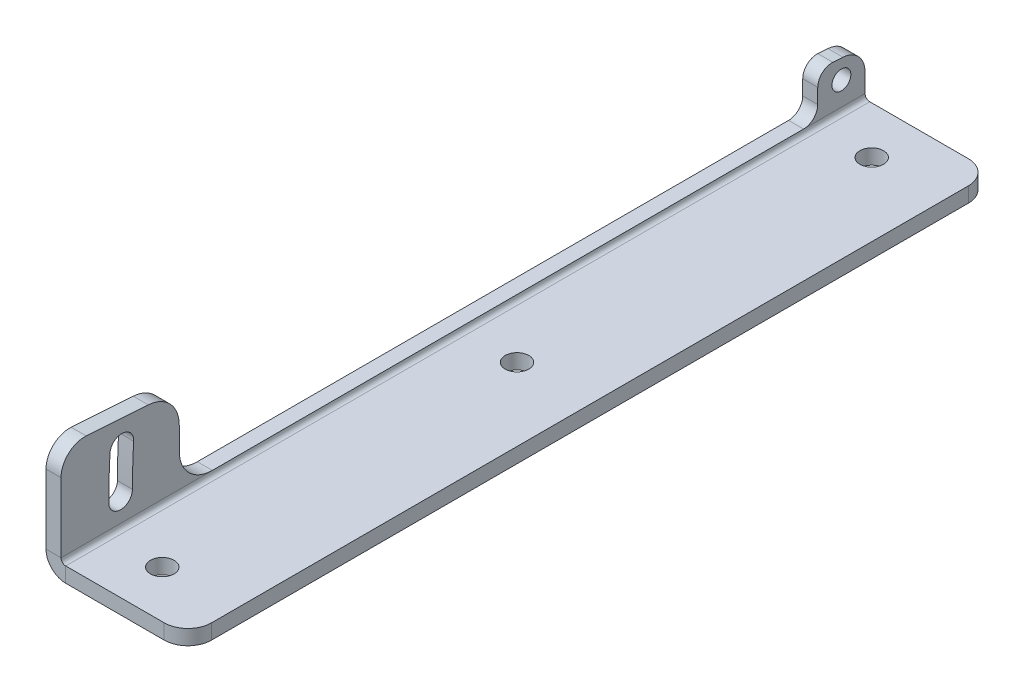
ISO-10303-21;
HEADER;
FILE_DESCRIPTION(('STEP AP214'),'2;1');
FILE_NAME('part.step','',(''),(''),'','','');
FILE_SCHEMA(('AUTOMOTIVE_DESIGN { 1 0 10303 214 1 1 1 1 }'));
ENDSEC;
DATA;
#1=APPLICATION_CONTEXT('core data for automotive mechanical design processes');
#2=APPLICATION_PROTOCOL_DEFINITION('international standard','automotive_design',2000,#1);
#3=PRODUCT_CONTEXT('',#1,'mechanical');
#4=PRODUCT('Part','Part','',(#3));
#5=PRODUCT_RELATED_PRODUCT_CATEGORY('part','',(#4));
#6=PRODUCT_DEFINITION_FORMATION('','',#4);
#7=PRODUCT_DEFINITION_CONTEXT('part definition',#1,'design');
#8=PRODUCT_DEFINITION('design','',#6,#7);
#9=PRODUCT_DEFINITION_SHAPE('','',#8);
#10=(LENGTH_UNIT() NAMED_UNIT(*) SI_UNIT(.MILLI.,.METRE.));
#11=(NAMED_UNIT(*) PLANE_ANGLE_UNIT() SI_UNIT($,.RADIAN.));
#12=(NAMED_UNIT(*) SI_UNIT($,.STERADIAN.) SOLID_ANGLE_UNIT());
#13=UNCERTAINTY_MEASURE_WITH_UNIT(LENGTH_MEASURE(1.E-05),#10,'distance_accuracy_value','');
#14=(GEOMETRIC_REPRESENTATION_CONTEXT(3) GLOBAL_UNCERTAINTY_ASSIGNED_CONTEXT((#13)) GLOBAL_UNIT_ASSIGNED_CONTEXT((#10,
#11,#12)) REPRESENTATION_CONTEXT('',''));
#15=CARTESIAN_POINT('',(0.,0.,0.));
#16=DIRECTION('',(0.,0.,1.));
#17=DIRECTION('',(1.,0.,0.));
#18=AXIS2_PLACEMENT_3D('',#15,#16,#17);
#19=CARTESIAN_POINT('',(-26.825,0.,170.));
#20=DIRECTION('',(-1.,0.,0.));
#21=DIRECTION('',(0.,0.,1.));
#22=AXIS2_PLACEMENT_3D('',#19,#20,#21);
#23=PLANE('',#22);
#24=CARTESIAN_POINT('',(-26.825,9.175,5.));
#25=DIRECTION('',(-1.,0.,0.));
#26=DIRECTION('',(0.,0.,1.));
#27=AXIS2_PLACEMENT_3D('',#24,#25,#26);
#28=CIRCLE('',#27,149.9);
#29=CARTESIAN_POINT('',(-26.825,17.8552329396325,154.648466601278));
#30=VERTEX_POINT('',#29);
#31=CARTESIAN_POINT('',(-26.825,9.175,154.9));
#32=VERTEX_POINT('',#31);
#33=EDGE_CURVE('E231',#30,#32,#28,.F.);
#34=ORIENTED_EDGE('',*,*,#33,.T.);
#35=CARTESIAN_POINT('',(-26.825,9.175,157.4));
#36=DIRECTION('',(-1.,0.,0.));
#37=DIRECTION('',(0.,0.,1.));
#38=AXIS2_PLACEMENT_3D('',#35,#36,#37);
#39=CIRCLE('',#38,2.5);
#40=CARTESIAN_POINT('',(-26.825,9.175,159.9));
#41=VERTEX_POINT('',#40);
#42=EDGE_CURVE('E234',#32,#41,#39,.T.);
#43=ORIENTED_EDGE('',*,*,#42,.T.);
#44=CARTESIAN_POINT('',(-26.825,9.175,5.));
#45=DIRECTION('',(-1.,0.,0.));
#46=DIRECTION('',(0.,0.,1.));
#47=AXIS2_PLACEMENT_3D('',#44,#45,#46);
#48=CIRCLE('',#47,154.9);
#49=CARTESIAN_POINT('',(-26.825,18.1447670603674,159.640076561294));
#50=VERTEX_POINT('',#49);
#51=EDGE_CURVE('E228',#41,#50,#48,.T.);
#52=ORIENTED_EDGE('',*,*,#51,.T.);
#53=CARTESIAN_POINT('',(-26.825,18.,157.144271581286));
#54=DIRECTION('',(-1.,0.,0.));
#55=DIRECTION('',(0.,0.,1.));
#56=AXIS2_PLACEMENT_3D('',#53,#54,#55);
#57=CIRCLE('',#56,2.49999999999999);
#58=EDGE_CURVE('E200',#50,#30,#57,.T.);
#59=ORIENTED_EDGE('',*,*,#58,.T.);
#60=EDGE_LOOP('',(#34,#43,#52,#59));
#61=FACE_BOUND('',#60,.T.);
#62=DIRECTION('',(0.,1.,0.));
#63=VECTOR('',#62,1.);
#64=CARTESIAN_POINT('',(-26.825,13.3423382382454,145.));
#65=LINE('',#64,#63);
#66=CARTESIAN_POINT('',(-26.825,15.9604537596054,145.));
#67=VERTEX_POINT('',#66);
#68=CARTESIAN_POINT('',(-26.825,11.175,145.));
#69=VERTEX_POINT('',#68);
#70=EDGE_CURVE('E404',#67,#69,#65,.F.);
#71=ORIENTED_EDGE('',*,*,#70,.F.);
#72=CARTESIAN_POINT('',(-26.825,15.9604537596054,152.));
#73=DIRECTION('',(-1.,0.,0.));
#74=DIRECTION('',(0.,0.,1.));
#75=AXIS2_PLACEMENT_3D('',#72,#73,#74);
#76=CIRCLE('',#75,7.);
#77=CARTESIAN_POINT('',(-26.825,22.9449747604819,151.534740515072));
#78=VERTEX_POINT('',#77);
#79=EDGE_CURVE('E380',#67,#78,#76,.F.);
#80=ORIENTED_EDGE('',*,*,#79,.T.);
#81=DIRECTION('',(0.,0.0664656407040234,0.997788714410924));
#82=VECTOR('',#81,1.);
#83=CARTESIAN_POINT('',(-26.825,24.0682025522953,168.396746244843));
#84=LINE('',#83,#82);
#85=CARTESIAN_POINT('',(-26.825,23.8197979363043,164.66767179648));
#86=VERTEX_POINT('',#85);
#87=EDGE_CURVE('E417',#78,#86,#84,.T.);
#88=ORIENTED_EDGE('',*,*,#87,.T.);
#89=CARTESIAN_POINT('',(-26.825,18.8308543642496,165.));
#90=DIRECTION('',(-1.,0.,0.));
#91=DIRECTION('',(0.,0.,1.));
#92=AXIS2_PLACEMENT_3D('',#89,#90,#91);
#93=CIRCLE('',#92,5.);
#94=CARTESIAN_POINT('',(-26.825,18.8308543642496,170.));
#95=VERTEX_POINT('',#94);
#96=EDGE_CURVE('E341',#86,#95,#93,.F.);
#97=ORIENTED_EDGE('',*,*,#96,.T.);
#98=DIRECTION('',(0.,1.,0.));
#99=VECTOR('',#98,1.);
#100=CARTESIAN_POINT('',(-26.825,0.,170.));
#101=LINE('',#100,#99);
#102=CARTESIAN_POINT('',(-26.825,4.175,170.));
#103=VERTEX_POINT('',#102);
#104=EDGE_CURVE('E241',#103,#95,#101,.T.);
#105=ORIENTED_EDGE('',*,*,#104,.F.);
#106=DIRECTION('',(0.,0.,-1.));
#107=VECTOR('',#106,1.);
#108=CARTESIAN_POINT('',(-26.825,4.175,170.));
#109=LINE('',#108,#107);
#110=CARTESIAN_POINT('',(-26.825,4.175,138.));
#111=VERTEX_POINT('',#110);
#112=EDGE_CURVE('E272',#103,#111,#109,.T.);
#113=ORIENTED_EDGE('',*,*,#112,.T.);
#114=CARTESIAN_POINT('',(-26.825,11.175,138.));
#115=DIRECTION('',(-1.,0.,0.));
#116=DIRECTION('',(0.,0.,1.));
#117=AXIS2_PLACEMENT_3D('',#114,#115,#116);
#118=CIRCLE('',#117,7.);
#119=EDGE_CURVE('E11',#111,#69,#118,.T.);
#120=ORIENTED_EDGE('',*,*,#119,.T.);
#121=EDGE_LOOP('',(#71,#80,#88,#97,#105,#113,#120));
#122=FACE_BOUND('',#121,.T.);
#123=ADVANCED_FACE('F36',(#61,#122),#23,.F.);
#124=CARTESIAN_POINT('',(-26.825,9.175,5.));
#125=DIRECTION('',(-1.,0.,0.));
#126=DIRECTION('',(0.,0.,1.));
#127=AXIS2_PLACEMENT_3D('',#124,#125,#126);
#128=CIRCLE('',#127,2.);
#129=CARTESIAN_POINT('',(-26.825,9.175,7.));
#130=VERTEX_POINT('',#129);
#131=EDGE_CURVE('E237',#130,#130,#128,.T.);
#132=ORIENTED_EDGE('',*,*,#131,.T.);
#133=EDGE_LOOP('',(#132));
#134=FACE_BOUND('',#133,.T.);
#135=CARTESIAN_POINT('',(-26.825,13.1617273858449,4.66767179647984));
#136=VERTEX_POINT('',#135);
#137=CARTESIAN_POINT('',(-26.825,13.3038082113232,6.80060307788788));
#138=VERTEX_POINT('',#137);
#139=EDGE_CURVE('E419',#136,#138,#84,.T.);
#140=ORIENTED_EDGE('',*,*,#139,.T.);
#141=CARTESIAN_POINT('',(-26.825,10.3104420680905,7.00000000000001));
#142=DIRECTION('',(-1.,0.,0.));
#143=DIRECTION('',(0.,0.,1.));
#144=AXIS2_PLACEMENT_3D('',#141,#142,#143);
#145=CIRCLE('',#144,3.);
#146=CARTESIAN_POINT('',(-26.825,10.3104420680905,10.));
#147=VERTEX_POINT('',#146);
#148=EDGE_CURVE('E360',#138,#147,#145,.F.);
#149=ORIENTED_EDGE('',*,*,#148,.T.);
#150=DIRECTION('',(0.,1.,0.));
#151=VECTOR('',#150,1.);
#152=CARTESIAN_POINT('',(-26.825,13.3423382382454,10.));
#153=LINE('',#152,#151);
#154=CARTESIAN_POINT('',(-26.825,7.175,10.));
#155=VERTEX_POINT('',#154);
#156=EDGE_CURVE('E409',#155,#147,#153,.T.);
#157=ORIENTED_EDGE('',*,*,#156,.F.);
#158=CARTESIAN_POINT('',(-26.825,7.175,13.));
#159=DIRECTION('',(-1.,0.,0.));
#160=DIRECTION('',(0.,0.,1.));
#161=AXIS2_PLACEMENT_3D('',#158,#159,#160);
#162=CIRCLE('',#161,3.);
#163=CARTESIAN_POINT('',(-26.825,4.175,13.));
#164=VERTEX_POINT('',#163);
#165=EDGE_CURVE('E364',#155,#164,#162,.T.);
#166=ORIENTED_EDGE('',*,*,#165,.T.);
#167=CARTESIAN_POINT('',(-26.825,4.175,0.));
#168=VERTEX_POINT('',#167);
#169=EDGE_CURVE('E257',#164,#168,#109,.T.);
#170=ORIENTED_EDGE('',*,*,#169,.T.);
#171=DIRECTION('',(0.,1.,0.));
#172=VECTOR('',#171,1.);
#173=CARTESIAN_POINT('',(-26.825,0.,0.));
#174=LINE('',#173,#172);
#175=CARTESIAN_POINT('',(-26.825,8.1727838137903,0.));
#176=VERTEX_POINT('',#175);
#177=EDGE_CURVE('E240',#168,#176,#174,.T.);
#178=ORIENTED_EDGE('',*,*,#177,.T.);
#179=CARTESIAN_POINT('',(-26.825,8.1727838137903,5.));
#180=DIRECTION('',(-1.,0.,0.));
#181=DIRECTION('',(0.,0.,1.));
#182=AXIS2_PLACEMENT_3D('',#179,#180,#181);
#183=CIRCLE('',#182,5.);
#184=EDGE_CURVE('E343',#176,#136,#183,.F.);
#185=ORIENTED_EDGE('',*,*,#184,.T.);
#186=EDGE_LOOP('',(#140,#149,#157,#166,#170,#178,#185));
#187=FACE_BOUND('',#186,.T.);
#188=ADVANCED_FACE('F439',(#134,#187),#23,.F.);
#189=CARTESIAN_POINT('',(-30.,0.,170.));
#190=DIRECTION('',(-1.,0.,0.));
#191=DIRECTION('',(0.,0.,1.));
#192=AXIS2_PLACEMENT_3D('',#189,#190,#191);
#193=PLANE('',#192);
#194=CARTESIAN_POINT('',(-30.,9.175,157.4));
#195=DIRECTION('',(-1.,0.,0.));
#196=DIRECTION('',(0.,0.,1.));
#197=AXIS2_PLACEMENT_3D('',#194,#195,#196);
#198=CIRCLE('',#197,2.5);
#199=CARTESIAN_POINT('',(-30.,9.175,154.9));
#200=VERTEX_POINT('',#199);
#201=CARTESIAN_POINT('',(-30.,9.175,159.9));
#202=VERTEX_POINT('',#201);
#203=EDGE_CURVE('E213',#200,#202,#198,.T.);
#204=ORIENTED_EDGE('',*,*,#203,.F.);
#205=CARTESIAN_POINT('',(-30.,9.175,5.));
#206=DIRECTION('',(1.,0.,0.));
#207=DIRECTION('',(0.,0.,1.));
#208=AXIS2_PLACEMENT_3D('',#205,#206,#207);
#209=CIRCLE('',#208,149.9);
#210=CARTESIAN_POINT('',(-30.,17.8552329396325,154.648466601278));
#211=VERTEX_POINT('',#210);
#212=EDGE_CURVE('E218',#211,#200,#209,.T.);
#213=ORIENTED_EDGE('',*,*,#212,.F.);
#214=CARTESIAN_POINT('',(-30.,18.,157.144271581286));
#215=DIRECTION('',(-1.,0.,0.));
#216=DIRECTION('',(0.,0.,1.));
#217=AXIS2_PLACEMENT_3D('',#214,#215,#216);
#218=CIRCLE('',#217,2.49999999999999);
#219=CARTESIAN_POINT('',(-30.,18.1447670603674,159.640076561294));
#220=VERTEX_POINT('',#219);
#221=EDGE_CURVE('E197',#220,#211,#218,.T.);
#222=ORIENTED_EDGE('',*,*,#221,.F.);
#223=CARTESIAN_POINT('',(-30.,9.175,5.));
#224=DIRECTION('',(-1.,0.,0.));
#225=DIRECTION('',(0.,0.,1.));
#226=AXIS2_PLACEMENT_3D('',#223,#224,#225);
#227=CIRCLE('',#226,154.9);
#228=EDGE_CURVE('E208',#202,#220,#227,.T.);
#229=ORIENTED_EDGE('',*,*,#228,.F.);
#230=EDGE_LOOP('',(#204,#213,#222,#229));
#231=FACE_BOUND('',#230,.T.);
#232=DIRECTION('',(0.,0.0664656407040233,0.997788714410924));
#233=VECTOR('',#232,1.);
#234=CARTESIAN_POINT('',(-30.,12.850800040137,0.));
#235=LINE('',#234,#233);
#236=CARTESIAN_POINT('',(-30.,22.9449747604819,151.534740515072));
#237=VERTEX_POINT('',#236);
#238=CARTESIAN_POINT('',(-30.,23.8197979363042,164.66767179648));
#239=VERTEX_POINT('',#238);
#240=EDGE_CURVE('E418',#237,#239,#235,.T.);
#241=ORIENTED_EDGE('',*,*,#240,.F.);
#242=CARTESIAN_POINT('',(-30.,15.9604537596054,152.));
#243=DIRECTION('',(-1.,0.,0.));
#244=DIRECTION('',(0.,0.,1.));
#245=AXIS2_PLACEMENT_3D('',#242,#243,#244);
#246=CIRCLE('',#245,7.);
#247=CARTESIAN_POINT('',(-30.,15.9604537596054,145.));
#248=VERTEX_POINT('',#247);
#249=EDGE_CURVE('E378',#237,#248,#246,.T.);
#250=ORIENTED_EDGE('',*,*,#249,.T.);
#251=DIRECTION('',(0.,-1.,0.));
#252=VECTOR('',#251,1.);
#253=CARTESIAN_POINT('',(-30.,0.,145.));
#254=LINE('',#253,#252);
#255=CARTESIAN_POINT('',(-30.,11.175,145.));
#256=VERTEX_POINT('',#255);
#257=EDGE_CURVE('E387',#248,#256,#254,.T.);
#258=ORIENTED_EDGE('',*,*,#257,.T.);
#259=CARTESIAN_POINT('',(-30.,11.175,138.));
#260=DIRECTION('',(-1.,0.,0.));
#261=DIRECTION('',(0.,0.,1.));
#262=AXIS2_PLACEMENT_3D('',#259,#260,#261);
#263=CIRCLE('',#262,7.);
#264=CARTESIAN_POINT('',(-30.,4.175,138.));
#265=VERTEX_POINT('',#264);
#266=EDGE_CURVE('E45',#256,#265,#263,.F.);
#267=ORIENTED_EDGE('',*,*,#266,.T.);
#268=DIRECTION('',(0.,0.,-1.));
#269=VECTOR('',#268,1.);
#270=CARTESIAN_POINT('',(-30.,4.175,170.));
#271=LINE('',#270,#269);
#272=CARTESIAN_POINT('',(-30.,4.175,170.));
#273=VERTEX_POINT('',#272);
#274=EDGE_CURVE('E52',#273,#265,#271,.T.);
#275=ORIENTED_EDGE('',*,*,#274,.F.);
#276=DIRECTION('',(0.,1.,0.));
#277=VECTOR('',#276,1.);
#278=CARTESIAN_POINT('',(-30.,0.,170.));
#279=LINE('',#278,#277);
#280=CARTESIAN_POINT('',(-30.,18.8308543642496,170.));
#281=VERTEX_POINT('',#280);
#282=EDGE_CURVE('E244',#273,#281,#279,.T.);
#283=ORIENTED_EDGE('',*,*,#282,.T.);
#284=CARTESIAN_POINT('',(-30.,18.8308543642496,165.));
#285=DIRECTION('',(-1.,0.,0.));
#286=DIRECTION('',(0.,0.,1.));
#287=AXIS2_PLACEMENT_3D('',#284,#285,#286);
#288=CIRCLE('',#287,5.);
#289=EDGE_CURVE('E334',#281,#239,#288,.T.);
#290=ORIENTED_EDGE('',*,*,#289,.T.);
#291=EDGE_LOOP('',(#241,#250,#258,#267,#275,#283,#290));
#292=FACE_BOUND('',#291,.T.);
#293=ADVANCED_FACE('F215',(#231,#292),#193,.T.);
#294=CARTESIAN_POINT('',(-30.,9.175,5.));
#295=DIRECTION('',(-1.,0.,0.));
#296=DIRECTION('',(0.,0.,1.));
#297=AXIS2_PLACEMENT_3D('',#294,#295,#296);
#298=CIRCLE('',#297,2.);
#299=CARTESIAN_POINT('',(-30.,9.175,7.));
#300=VERTEX_POINT('',#299);
#301=EDGE_CURVE('E225',#300,#300,#298,.T.);
#302=ORIENTED_EDGE('',*,*,#301,.F.);
#303=EDGE_LOOP('',(#302));
#304=FACE_BOUND('',#303,.T.);
#305=DIRECTION('',(0.,1.,0.));
#306=VECTOR('',#305,1.);
#307=CARTESIAN_POINT('',(-30.,0.,10.));
#308=LINE('',#307,#306);
#309=CARTESIAN_POINT('',(-30.,7.175,10.));
#310=VERTEX_POINT('',#309);
#311=CARTESIAN_POINT('',(-30.,10.3104420680905,10.));
#312=VERTEX_POINT('',#311);
#313=EDGE_CURVE('E403',#310,#312,#308,.T.);
#314=ORIENTED_EDGE('',*,*,#313,.T.);
#315=CARTESIAN_POINT('',(-30.,10.3104420680905,7.00000000000001));
#316=DIRECTION('',(-1.,0.,0.));
#317=DIRECTION('',(0.,0.,1.));
#318=AXIS2_PLACEMENT_3D('',#315,#316,#317);
#319=CIRCLE('',#318,3.);
#320=CARTESIAN_POINT('',(-30.,13.3038082113232,6.80060307788794));
#321=VERTEX_POINT('',#320);
#322=EDGE_CURVE('E356',#312,#321,#319,.T.);
#323=ORIENTED_EDGE('',*,*,#322,.T.);
#324=CARTESIAN_POINT('',(-30.,13.1617273858449,4.66767179647988));
#325=VERTEX_POINT('',#324);
#326=EDGE_CURVE('E414',#325,#321,#235,.T.);
#327=ORIENTED_EDGE('',*,*,#326,.F.);
#328=CARTESIAN_POINT('',(-30.,8.1727838137903,5.));
#329=DIRECTION('',(-1.,0.,0.));
#330=DIRECTION('',(0.,0.,1.));
#331=AXIS2_PLACEMENT_3D('',#328,#329,#330);
#332=CIRCLE('',#331,5.);
#333=CARTESIAN_POINT('',(-30.,8.1727838137903,0.));
#334=VERTEX_POINT('',#333);
#335=EDGE_CURVE('E337',#325,#334,#332,.T.);
#336=ORIENTED_EDGE('',*,*,#335,.T.);
#337=DIRECTION('',(0.,1.,0.));
#338=VECTOR('',#337,1.);
#339=CARTESIAN_POINT('',(-30.,0.,0.));
#340=LINE('',#339,#338);
#341=CARTESIAN_POINT('',(-30.,4.175,0.));
#342=VERTEX_POINT('',#341);
#343=EDGE_CURVE('E260',#342,#334,#340,.T.);
#344=ORIENTED_EDGE('',*,*,#343,.F.);
#345=CARTESIAN_POINT('',(-30.,4.175,13.));
#346=VERTEX_POINT('',#345);
#347=EDGE_CURVE('E287',#346,#342,#271,.T.);
#348=ORIENTED_EDGE('',*,*,#347,.F.);
#349=CARTESIAN_POINT('',(-30.,7.175,13.));
#350=DIRECTION('',(-1.,0.,0.));
#351=DIRECTION('',(0.,0.,1.));
#352=AXIS2_PLACEMENT_3D('',#349,#350,#351);
#353=CIRCLE('',#352,3.);
#354=EDGE_CURVE('E362',#346,#310,#353,.F.);
#355=ORIENTED_EDGE('',*,*,#354,.T.);
#356=EDGE_LOOP('',(#314,#323,#327,#336,#344,#348,#355));
#357=FACE_BOUND('',#356,.T.);
#358=ADVANCED_FACE('F458',(#304,#357),#193,.T.);
#359=CARTESIAN_POINT('',(0.,12.850800040137,0.));
#360=DIRECTION('',(0.,-0.997788714410924,0.0664656407040233));
#361=DIRECTION('',(0.,-0.0664656407040234,-0.997788714410924));
#362=AXIS2_PLACEMENT_3D('',#359,#360,#361);
#363=PLANE('',#362);
#364=ORIENTED_EDGE('',*,*,#87,.F.);
#365=DIRECTION('',(1.,0.,0.));
#366=VECTOR('',#365,1.);
#367=CARTESIAN_POINT('',(-30.,22.9449747604819,151.534740515072));
#368=LINE('',#367,#366);
#369=EDGE_CURVE('E375',#78,#237,#368,.F.);
#370=ORIENTED_EDGE('',*,*,#369,.T.);
#371=ORIENTED_EDGE('',*,*,#240,.T.);
#372=DIRECTION('',(-1.,0.,0.));
#373=VECTOR('',#372,1.);
#374=CARTESIAN_POINT('',(-26.825,23.8197979363042,164.66767179648));
#375=LINE('',#374,#373);
#376=EDGE_CURVE('E318',#239,#86,#375,.F.);
#377=ORIENTED_EDGE('',*,*,#376,.T.);
#378=EDGE_LOOP('',(#364,#370,#371,#377));
#379=FACE_BOUND('',#378,.T.);
#380=ADVANCED_FACE('F449',(#379),#363,.F.);
#381=ORIENTED_EDGE('',*,*,#326,.T.);
#382=DIRECTION('',(1.,0.,0.));
#383=VECTOR('',#382,1.);
#384=CARTESIAN_POINT('',(-26.825,13.3038082113232,6.80060307788794));
#385=LINE('',#384,#383);
#386=EDGE_CURVE('E358',#321,#138,#385,.T.);
#387=ORIENTED_EDGE('',*,*,#386,.T.);
#388=ORIENTED_EDGE('',*,*,#139,.F.);
#389=DIRECTION('',(-1.,0.,0.));
#390=VECTOR('',#389,1.);
#391=CARTESIAN_POINT('',(0.,13.1617273858449,4.66767179647988));
#392=LINE('',#391,#390);
#393=EDGE_CURVE('E331',#136,#325,#392,.T.);
#394=ORIENTED_EDGE('',*,*,#393,.T.);
#395=EDGE_LOOP('',(#381,#387,#388,#394));
#396=FACE_BOUND('',#395,.T.);
#397=ADVANCED_FACE('F478',(#396),#363,.F.);
#398=CARTESIAN_POINT('',(-30.,4.175,170.));
#399=DIRECTION('',(0.,0.,1.));
#400=DIRECTION('',(1.,0.,0.));
#401=AXIS2_PLACEMENT_3D('',#398,#399,#400);
#402=PLANE('',#401);
#403=DIRECTION('',(1.,0.,0.));
#404=VECTOR('',#403,1.);
#405=CARTESIAN_POINT('',(-30.,4.175,170.));
#406=LINE('',#405,#404);
#407=EDGE_CURVE('E298',#273,#103,#406,.T.);
#408=ORIENTED_EDGE('',*,*,#407,.F.);
#409=CARTESIAN_POINT('',(-25.825,4.175,170.));
#410=DIRECTION('',(0.,0.,1.));
#411=DIRECTION('',(1.,0.,0.));
#412=AXIS2_PLACEMENT_3D('',#409,#410,#411);
#413=CIRCLE('',#412,4.175);
#414=CARTESIAN_POINT('',(-25.825,0.,170.));
#415=VERTEX_POINT('',#414);
#416=EDGE_CURVE('E248',#415,#273,#413,.F.);
#417=ORIENTED_EDGE('',*,*,#416,.F.);
#418=DIRECTION('',(0.,-1.,0.));
#419=VECTOR('',#418,1.);
#420=CARTESIAN_POINT('',(-25.825,3.175,170.));
#421=LINE('',#420,#419);
#422=CARTESIAN_POINT('',(-25.825,3.175,170.));
#423=VERTEX_POINT('',#422);
#424=EDGE_CURVE('E295',#423,#415,#421,.T.);
#425=ORIENTED_EDGE('',*,*,#424,.F.);
#426=CARTESIAN_POINT('',(-25.825,4.175,170.));
#427=DIRECTION('',(0.,0.,1.));
#428=DIRECTION('',(1.,0.,0.));
#429=AXIS2_PLACEMENT_3D('',#426,#427,#428);
#430=CIRCLE('',#429,1.);
#431=EDGE_CURVE('E254',#423,#103,#430,.F.);
#432=ORIENTED_EDGE('',*,*,#431,.T.);
#433=EDGE_LOOP('',(#408,#417,#425,#432));
#434=FACE_BOUND('',#433,.T.);
#435=ADVANCED_FACE('F510',(#434),#402,.T.);
#436=CARTESIAN_POINT('',(-25.825,3.175,170.));
#437=DIRECTION('',(0.,0.,1.));
#438=DIRECTION('',(1.,0.,0.));
#439=AXIS2_PLACEMENT_3D('',#436,#437,#438);
#440=PLANE('',#439);
#441=ORIENTED_EDGE('',*,*,#104,.T.);
#442=DIRECTION('',(-1.,0.,0.));
#443=VECTOR('',#442,1.);
#444=CARTESIAN_POINT('',(-30.,18.8308543642496,170.));
#445=LINE('',#444,#443);
#446=EDGE_CURVE('E345',#95,#281,#445,.T.);
#447=ORIENTED_EDGE('',*,*,#446,.T.);
#448=ORIENTED_EDGE('',*,*,#282,.F.);
#449=ORIENTED_EDGE('',*,*,#407,.T.);
#450=EDGE_LOOP('',(#441,#447,#448,#449));
#451=FACE_BOUND('',#450,.T.);
#452=ADVANCED_FACE('F512',(#451),#440,.T.);
#453=CARTESIAN_POINT('',(-25.825,0.,0.));
#454=DIRECTION('',(0.,0.,-1.));
#455=DIRECTION('',(-1.,0.,0.));
#456=AXIS2_PLACEMENT_3D('',#453,#454,#455);
#457=PLANE('',#456);
#458=DIRECTION('',(0.,1.,0.));
#459=VECTOR('',#458,1.);
#460=CARTESIAN_POINT('',(-25.825,0.,0.));
#461=LINE('',#460,#459);
#462=CARTESIAN_POINT('',(-25.825,0.,0.));
#463=VERTEX_POINT('',#462);
#464=CARTESIAN_POINT('',(-25.825,3.175,0.));
#465=VERTEX_POINT('',#464);
#466=EDGE_CURVE('E292',#463,#465,#461,.T.);
#467=ORIENTED_EDGE('',*,*,#466,.F.);
#468=CARTESIAN_POINT('',(-25.825,4.175,0.));
#469=DIRECTION('',(0.,0.,1.));
#470=DIRECTION('',(1.,0.,0.));
#471=AXIS2_PLACEMENT_3D('',#468,#469,#470);
#472=CIRCLE('',#471,4.175);
#473=EDGE_CURVE('E263',#463,#342,#472,.F.);
#474=ORIENTED_EDGE('',*,*,#473,.T.);
#475=DIRECTION('',(-1.,0.,0.));
#476=VECTOR('',#475,1.);
#477=CARTESIAN_POINT('',(-26.825,4.175,0.));
#478=LINE('',#477,#476);
#479=EDGE_CURVE('E289',#168,#342,#478,.T.);
#480=ORIENTED_EDGE('',*,*,#479,.F.);
#481=CARTESIAN_POINT('',(-25.825,4.175,0.));
#482=DIRECTION('',(0.,0.,1.));
#483=DIRECTION('',(1.,0.,0.));
#484=AXIS2_PLACEMENT_3D('',#481,#482,#483);
#485=CIRCLE('',#484,1.);
#486=EDGE_CURVE('E245',#465,#168,#485,.F.);
#487=ORIENTED_EDGE('',*,*,#486,.F.);
#488=EDGE_LOOP('',(#467,#474,#480,#487));
#489=FACE_BOUND('',#488,.T.);
#490=ADVANCED_FACE('F491',(#489),#457,.T.);
#491=CARTESIAN_POINT('',(-26.825,4.175,0.));
#492=DIRECTION('',(0.,0.,-1.));
#493=DIRECTION('',(-1.,0.,0.));
#494=AXIS2_PLACEMENT_3D('',#491,#492,#493);
#495=PLANE('',#494);
#496=DIRECTION('',(1.,0.,0.));
#497=VECTOR('',#496,1.);
#498=CARTESIAN_POINT('',(0.,3.175,0.));
#499=LINE('',#498,#497);
#500=CARTESIAN_POINT('',(-5.,3.175,0.));
#501=VERTEX_POINT('',#500);
#502=EDGE_CURVE('E268',#501,#465,#499,.F.);
#503=ORIENTED_EDGE('',*,*,#502,.F.);
#504=DIRECTION('',(0.,-1.,0.));
#505=VECTOR('',#504,1.);
#506=CARTESIAN_POINT('',(-5.,4.175,0.));
#507=LINE('',#506,#505);
#508=CARTESIAN_POINT('',(-5.,0.,0.));
#509=VERTEX_POINT('',#508);
#510=EDGE_CURVE('E300',#501,#509,#507,.T.);
#511=ORIENTED_EDGE('',*,*,#510,.T.);
#512=DIRECTION('',(-1.,0.,0.));
#513=VECTOR('',#512,1.);
#514=CARTESIAN_POINT('',(0.,0.,0.));
#515=LINE('',#514,#513);
#516=EDGE_CURVE('E266',#509,#463,#515,.T.);
#517=ORIENTED_EDGE('',*,*,#516,.T.);
#518=ORIENTED_EDGE('',*,*,#466,.T.);
#519=EDGE_LOOP('',(#503,#511,#517,#518));
#520=FACE_BOUND('',#519,.T.);
#521=ADVANCED_FACE('F501',(#520),#495,.T.);
#522=CARTESIAN_POINT('',(-25.825,4.175,170.));
#523=DIRECTION('',(0.,0.,-1.));
#524=DIRECTION('',(-1.,0.,0.));
#525=AXIS2_PLACEMENT_3D('',#522,#523,#524);
#526=CYLINDRICAL_SURFACE('',#525,4.175);
#527=ORIENTED_EDGE('',*,*,#473,.F.);
#528=DIRECTION('',(0.,0.,-1.));
#529=VECTOR('',#528,1.);
#530=CARTESIAN_POINT('',(-25.825,0.,170.));
#531=LINE('',#530,#529);
#532=EDGE_CURVE('E284',#415,#463,#531,.T.);
#533=ORIENTED_EDGE('',*,*,#532,.F.);
#534=ORIENTED_EDGE('',*,*,#416,.T.);
#535=ORIENTED_EDGE('',*,*,#274,.T.);
#536=DIRECTION('',(0.,0.,-1.));
#537=VECTOR('',#536,1.);
#538=CARTESIAN_POINT('',(-30.,4.175,170.));
#539=LINE('',#538,#537);
#540=EDGE_CURVE('E397',#265,#346,#539,.T.);
#541=ORIENTED_EDGE('',*,*,#540,.T.);
#542=ORIENTED_EDGE('',*,*,#347,.T.);
#543=EDGE_LOOP('',(#527,#533,#534,#535,#541,#542));
#544=FACE_BOUND('',#543,.T.);
#545=ADVANCED_FACE('F454',(#544),#526,.T.);
#546=CARTESIAN_POINT('',(0.,0.,170.));
#547=DIRECTION('',(0.,-1.,0.));
#548=DIRECTION('',(0.,0.,-1.));
#549=AXIS2_PLACEMENT_3D('',#546,#547,#548);
#550=PLANE('',#549);
#551=CARTESIAN_POINT('',(-15.4125,0.,160.));
#552=DIRECTION('',(0.,-1.,0.));
#553=DIRECTION('',(0.,0.,-1.));
#554=AXIS2_PLACEMENT_3D('',#551,#552,#553);
#555=CIRCLE('',#554,2.5);
#556=CARTESIAN_POINT('',(-15.4125,0.,157.5));
#557=VERTEX_POINT('',#556);
#558=EDGE_CURVE('E323',#557,#557,#555,.T.);
#559=ORIENTED_EDGE('',*,*,#558,.F.);
#560=EDGE_LOOP('',(#559));
#561=FACE_BOUND('',#560,.T.);
#562=CARTESIAN_POINT('',(-15.4125,0.,85.));
#563=DIRECTION('',(0.,-1.,0.));
#564=DIRECTION('',(0.,0.,-1.));
#565=AXIS2_PLACEMENT_3D('',#562,#563,#564);
#566=CIRCLE('',#565,2.5);
#567=CARTESIAN_POINT('',(-15.4125,0.,82.5));
#568=VERTEX_POINT('',#567);
#569=EDGE_CURVE('E425',#568,#568,#566,.T.);
#570=ORIENTED_EDGE('',*,*,#569,.F.);
#571=EDGE_LOOP('',(#570));
#572=FACE_BOUND('',#571,.T.);
#573=CARTESIAN_POINT('',(-15.4125,0.,10.));
#574=DIRECTION('',(0.,-1.,0.));
#575=DIRECTION('',(0.,0.,-1.));
#576=AXIS2_PLACEMENT_3D('',#573,#574,#575);
#577=CIRCLE('',#576,2.5);
#578=CARTESIAN_POINT('',(-15.4125,0.,7.5));
#579=VERTEX_POINT('',#578);
#580=EDGE_CURVE('E422',#579,#579,#577,.T.);
#581=ORIENTED_EDGE('',*,*,#580,.F.);
#582=EDGE_LOOP('',(#581));
#583=FACE_BOUND('',#582,.T.);
#584=ORIENTED_EDGE('',*,*,#516,.F.);
#585=CARTESIAN_POINT('',(-5.,0.,5.));
#586=DIRECTION('',(0.,-1.,0.));
#587=DIRECTION('',(0.,0.,-1.));
#588=AXIS2_PLACEMENT_3D('',#585,#586,#587);
#589=CIRCLE('',#588,5.);
#590=CARTESIAN_POINT('',(0.,0.,5.));
#591=VERTEX_POINT('',#590);
#592=EDGE_CURVE('E305',#509,#591,#589,.T.);
#593=ORIENTED_EDGE('',*,*,#592,.T.);
#594=DIRECTION('',(0.,0.,-1.));
#595=VECTOR('',#594,1.);
#596=CARTESIAN_POINT('',(0.,0.,170.));
#597=LINE('',#596,#595);
#598=CARTESIAN_POINT('',(0.,0.,165.));
#599=VERTEX_POINT('',#598);
#600=EDGE_CURVE('E281',#599,#591,#597,.T.);
#601=ORIENTED_EDGE('',*,*,#600,.F.);
#602=CARTESIAN_POINT('',(-5.,0.,165.));
#603=DIRECTION('',(0.,-1.,0.));
#604=DIRECTION('',(0.,0.,-1.));
#605=AXIS2_PLACEMENT_3D('',#602,#603,#604);
#606=CIRCLE('',#605,5.);
#607=CARTESIAN_POINT('',(-5.,0.,170.));
#608=VERTEX_POINT('',#607);
#609=EDGE_CURVE('E303',#599,#608,#606,.T.);
#610=ORIENTED_EDGE('',*,*,#609,.T.);
#611=DIRECTION('',(-1.,0.,0.));
#612=VECTOR('',#611,1.);
#613=CARTESIAN_POINT('',(0.,0.,170.));
#614=LINE('',#613,#612);
#615=EDGE_CURVE('E250',#608,#415,#614,.T.);
#616=ORIENTED_EDGE('',*,*,#615,.T.);
#617=ORIENTED_EDGE('',*,*,#532,.T.);
#618=EDGE_LOOP('',(#584,#593,#601,#610,#616,#617));
#619=FACE_BOUND('',#618,.T.);
#620=ADVANCED_FACE('F505',(#561,#572,#583,#619),#550,.T.);
#621=CARTESIAN_POINT('',(0.,3.175,170.));
#622=DIRECTION('',(1.,0.,0.));
#623=DIRECTION('',(0.,0.,-1.));
#624=AXIS2_PLACEMENT_3D('',#621,#622,#623);
#625=PLANE('',#624);
#626=ORIENTED_EDGE('',*,*,#600,.T.);
#627=DIRECTION('',(0.,-1.,0.));
#628=VECTOR('',#627,1.);
#629=CARTESIAN_POINT('',(0.,3.175,5.));
#630=LINE('',#629,#628);
#631=CARTESIAN_POINT('',(0.,3.175,5.));
#632=VERTEX_POINT('',#631);
#633=EDGE_CURVE('E310',#591,#632,#630,.F.);
#634=ORIENTED_EDGE('',*,*,#633,.T.);
#635=DIRECTION('',(0.,0.,-1.));
#636=VECTOR('',#635,1.);
#637=CARTESIAN_POINT('',(0.,3.175,170.));
#638=LINE('',#637,#636);
#639=CARTESIAN_POINT('',(0.,3.175,165.));
#640=VERTEX_POINT('',#639);
#641=EDGE_CURVE('E278',#640,#632,#638,.T.);
#642=ORIENTED_EDGE('',*,*,#641,.F.);
#643=DIRECTION('',(0.,-1.,0.));
#644=VECTOR('',#643,1.);
#645=CARTESIAN_POINT('',(0.,3.175,165.));
#646=LINE('',#645,#644);
#647=EDGE_CURVE('E307',#640,#599,#646,.T.);
#648=ORIENTED_EDGE('',*,*,#647,.T.);
#649=EDGE_LOOP('',(#626,#634,#642,#648));
#650=FACE_BOUND('',#649,.T.);
#651=ADVANCED_FACE('F710',(#650),#625,.T.);
#652=CARTESIAN_POINT('',(0.,3.175,170.));
#653=DIRECTION('',(0.,-1.,0.));
#654=DIRECTION('',(0.,0.,-1.));
#655=AXIS2_PLACEMENT_3D('',#652,#653,#654);
#656=PLANE('',#655);
#657=CARTESIAN_POINT('',(-15.4125,3.175,160.));
#658=DIRECTION('',(0.,-1.,0.));
#659=DIRECTION('',(0.,0.,-1.));
#660=AXIS2_PLACEMENT_3D('',#657,#658,#659);
#661=CIRCLE('',#660,2.5);
#662=CARTESIAN_POINT('',(-15.4125,3.175,157.5));
#663=VERTEX_POINT('',#662);
#664=EDGE_CURVE('E326',#663,#663,#661,.T.);
#665=ORIENTED_EDGE('',*,*,#664,.T.);
#666=EDGE_LOOP('',(#665));
#667=FACE_BOUND('',#666,.T.);
#668=CARTESIAN_POINT('',(-15.4125,3.175,85.));
#669=DIRECTION('',(0.,-1.,0.));
#670=DIRECTION('',(0.,0.,-1.));
#671=AXIS2_PLACEMENT_3D('',#668,#669,#670);
#672=CIRCLE('',#671,2.5);
#673=CARTESIAN_POINT('',(-15.4125,3.175,82.5));
#674=VERTEX_POINT('',#673);
#675=EDGE_CURVE('E322',#674,#674,#672,.T.);
#676=ORIENTED_EDGE('',*,*,#675,.T.);
#677=EDGE_LOOP('',(#676));
#678=FACE_BOUND('',#677,.T.);
#679=CARTESIAN_POINT('',(-15.4125,3.175,10.));
#680=DIRECTION('',(0.,-1.,0.));
#681=DIRECTION('',(0.,0.,-1.));
#682=AXIS2_PLACEMENT_3D('',#679,#680,#681);
#683=CIRCLE('',#682,2.5);
#684=CARTESIAN_POINT('',(-15.4125,3.175,7.5));
#685=VERTEX_POINT('',#684);
#686=EDGE_CURVE('E319',#685,#685,#683,.T.);
#687=ORIENTED_EDGE('',*,*,#686,.T.);
#688=EDGE_LOOP('',(#687));
#689=FACE_BOUND('',#688,.T.);
#690=ORIENTED_EDGE('',*,*,#641,.T.);
#691=CARTESIAN_POINT('',(-5.,3.175,5.));
#692=DIRECTION('',(0.,-1.,0.));
#693=DIRECTION('',(0.,0.,-1.));
#694=AXIS2_PLACEMENT_3D('',#691,#692,#693);
#695=CIRCLE('',#694,5.);
#696=EDGE_CURVE('E314',#632,#501,#695,.F.);
#697=ORIENTED_EDGE('',*,*,#696,.T.);
#698=ORIENTED_EDGE('',*,*,#502,.T.);
#699=DIRECTION('',(0.,0.,-1.));
#700=VECTOR('',#699,1.);
#701=CARTESIAN_POINT('',(-25.825,3.175,170.));
#702=LINE('',#701,#700);
#703=EDGE_CURVE('E275',#423,#465,#702,.T.);
#704=ORIENTED_EDGE('',*,*,#703,.F.);
#705=DIRECTION('',(1.,0.,0.));
#706=VECTOR('',#705,1.);
#707=CARTESIAN_POINT('',(0.,3.175,170.));
#708=LINE('',#707,#706);
#709=CARTESIAN_POINT('',(-5.,3.175,170.));
#710=VERTEX_POINT('',#709);
#711=EDGE_CURVE('E252',#710,#423,#708,.F.);
#712=ORIENTED_EDGE('',*,*,#711,.F.);
#713=CARTESIAN_POINT('',(-5.,3.175,165.));
#714=DIRECTION('',(0.,-1.,0.));
#715=DIRECTION('',(0.,0.,-1.));
#716=AXIS2_PLACEMENT_3D('',#713,#714,#715);
#717=CIRCLE('',#716,5.);
#718=EDGE_CURVE('E312',#710,#640,#717,.F.);
#719=ORIENTED_EDGE('',*,*,#718,.T.);
#720=EDGE_LOOP('',(#690,#697,#698,#704,#712,#719));
#721=FACE_BOUND('',#720,.T.);
#722=ADVANCED_FACE('F495',(#667,#678,#689,#721),#656,.F.);
#723=CARTESIAN_POINT('',(-25.825,4.175,170.));
#724=DIRECTION('',(0.,0.,-1.));
#725=DIRECTION('',(-1.,0.,0.));
#726=AXIS2_PLACEMENT_3D('',#723,#724,#725);
#727=CYLINDRICAL_SURFACE('',#726,1.);
#728=ORIENTED_EDGE('',*,*,#486,.T.);
#729=ORIENTED_EDGE('',*,*,#169,.F.);
#730=DIRECTION('',(0.,0.,-1.));
#731=VECTOR('',#730,1.);
#732=CARTESIAN_POINT('',(-26.825,4.175,77.5));
#733=LINE('',#732,#731);
#734=EDGE_CURVE('E395',#111,#164,#733,.T.);
#735=ORIENTED_EDGE('',*,*,#734,.F.);
#736=ORIENTED_EDGE('',*,*,#112,.F.);
#737=ORIENTED_EDGE('',*,*,#431,.F.);
#738=ORIENTED_EDGE('',*,*,#703,.T.);
#739=EDGE_LOOP('',(#728,#729,#735,#736,#737,#738));
#740=FACE_BOUND('',#739,.T.);
#741=ADVANCED_FACE('F400',(#740),#727,.F.);
#742=CARTESIAN_POINT('',(-25.825,4.175,170.));
#743=DIRECTION('',(0.,0.,1.));
#744=DIRECTION('',(1.,0.,0.));
#745=AXIS2_PLACEMENT_3D('',#742,#743,#744);
#746=PLANE('',#745);
#747=ORIENTED_EDGE('',*,*,#615,.F.);
#748=DIRECTION('',(0.,-1.,0.));
#749=VECTOR('',#748,1.);
#750=CARTESIAN_POINT('',(-5.,4.175,170.));
#751=LINE('',#750,#749);
#752=EDGE_CURVE('E316',#608,#710,#751,.F.);
#753=ORIENTED_EDGE('',*,*,#752,.T.);
#754=ORIENTED_EDGE('',*,*,#711,.T.);
#755=ORIENTED_EDGE('',*,*,#424,.T.);
#756=EDGE_LOOP('',(#747,#753,#754,#755));
#757=FACE_BOUND('',#756,.T.);
#758=ADVANCED_FACE('F572',(#757),#746,.T.);
#759=CARTESIAN_POINT('',(-25.825,4.175,0.));
#760=DIRECTION('',(0.,0.,1.));
#761=DIRECTION('',(1.,0.,0.));
#762=AXIS2_PLACEMENT_3D('',#759,#760,#761);
#763=PLANE('',#762);
#764=ORIENTED_EDGE('',*,*,#343,.T.);
#765=DIRECTION('',(-1.,0.,0.));
#766=VECTOR('',#765,1.);
#767=CARTESIAN_POINT('',(-25.825,8.1727838137903,0.));
#768=LINE('',#767,#766);
#769=EDGE_CURVE('E339',#334,#176,#768,.F.);
#770=ORIENTED_EDGE('',*,*,#769,.T.);
#771=ORIENTED_EDGE('',*,*,#177,.F.);
#772=ORIENTED_EDGE('',*,*,#479,.T.);
#773=EDGE_LOOP('',(#764,#770,#771,#772));
#774=FACE_BOUND('',#773,.T.);
#775=ADVANCED_FACE('F485',(#774),#763,.F.);
#776=CARTESIAN_POINT('',(-5.,4.175,5.));
#777=DIRECTION('',(0.,-1.,0.));
#778=DIRECTION('',(0.,0.,-1.));
#779=AXIS2_PLACEMENT_3D('',#776,#777,#778);
#780=CYLINDRICAL_SURFACE('',#779,5.);
#781=ORIENTED_EDGE('',*,*,#696,.F.);
#782=ORIENTED_EDGE('',*,*,#633,.F.);
#783=ORIENTED_EDGE('',*,*,#592,.F.);
#784=ORIENTED_EDGE('',*,*,#510,.F.);
#785=EDGE_LOOP('',(#781,#782,#783,#784));
#786=FACE_BOUND('',#785,.T.);
#787=ADVANCED_FACE('F653',(#786),#780,.T.);
#788=CARTESIAN_POINT('',(-5.,3.175,165.));
#789=DIRECTION('',(0.,-1.,0.));
#790=DIRECTION('',(0.,0.,-1.));
#791=AXIS2_PLACEMENT_3D('',#788,#789,#790);
#792=CYLINDRICAL_SURFACE('',#791,5.);
#793=ORIENTED_EDGE('',*,*,#718,.F.);
#794=ORIENTED_EDGE('',*,*,#752,.F.);
#795=ORIENTED_EDGE('',*,*,#609,.F.);
#796=ORIENTED_EDGE('',*,*,#647,.F.);
#797=EDGE_LOOP('',(#793,#794,#795,#796));
#798=FACE_BOUND('',#797,.T.);
#799=ADVANCED_FACE('F767',(#798),#792,.T.);
#800=CARTESIAN_POINT('',(0.,9.175,157.4));
#801=DIRECTION('',(-1.,0.,0.));
#802=DIRECTION('',(0.,0.,1.));
#803=AXIS2_PLACEMENT_3D('',#800,#801,#802);
#804=CYLINDRICAL_SURFACE('',#803,2.5);
#805=DIRECTION('',(-1.,0.,0.));
#806=VECTOR('',#805,1.);
#807=CARTESIAN_POINT('',(0.,9.175,154.9));
#808=LINE('',#807,#806);
#809=EDGE_CURVE('E223',#32,#200,#808,.T.);
#810=ORIENTED_EDGE('',*,*,#809,.T.);
#811=ORIENTED_EDGE('',*,*,#203,.T.);
#812=DIRECTION('',(-1.,0.,0.));
#813=VECTOR('',#812,1.);
#814=CARTESIAN_POINT('',(0.,9.175,159.9));
#815=LINE('',#814,#813);
#816=EDGE_CURVE('E204',#41,#202,#815,.T.);
#817=ORIENTED_EDGE('',*,*,#816,.F.);
#818=ORIENTED_EDGE('',*,*,#42,.F.);
#819=EDGE_LOOP('',(#810,#811,#817,#818));
#820=FACE_BOUND('',#819,.T.);
#821=ADVANCED_FACE('F432',(#820),#804,.F.);
#822=CARTESIAN_POINT('',(0.,9.175,5.));
#823=DIRECTION('',(-1.,0.,0.));
#824=DIRECTION('',(0.,0.,1.));
#825=AXIS2_PLACEMENT_3D('',#822,#823,#824);
#826=CYLINDRICAL_SURFACE('',#825,149.9);
#827=DIRECTION('',(-1.,0.,0.));
#828=VECTOR('',#827,1.);
#829=CARTESIAN_POINT('',(0.,17.8552329396325,154.648466601278));
#830=LINE('',#829,#828);
#831=EDGE_CURVE('E203',#30,#211,#830,.T.);
#832=ORIENTED_EDGE('',*,*,#831,.T.);
#833=ORIENTED_EDGE('',*,*,#212,.T.);
#834=ORIENTED_EDGE('',*,*,#809,.F.);
#835=ORIENTED_EDGE('',*,*,#33,.F.);
#836=EDGE_LOOP('',(#832,#833,#834,#835));
#837=FACE_BOUND('',#836,.T.);
#838=ADVANCED_FACE('F435',(#837),#826,.T.);
#839=CARTESIAN_POINT('',(0.,18.,157.144271581286));
#840=DIRECTION('',(-1.,0.,0.));
#841=DIRECTION('',(0.,0.,1.));
#842=AXIS2_PLACEMENT_3D('',#839,#840,#841);
#843=CYLINDRICAL_SURFACE('',#842,2.49999999999999);
#844=DIRECTION('',(-1.,0.,0.));
#845=VECTOR('',#844,1.);
#846=CARTESIAN_POINT('',(0.,18.1447670603674,159.640076561294));
#847=LINE('',#846,#845);
#848=EDGE_CURVE('E192',#50,#220,#847,.T.);
#849=ORIENTED_EDGE('',*,*,#848,.T.);
#850=ORIENTED_EDGE('',*,*,#221,.T.);
#851=ORIENTED_EDGE('',*,*,#831,.F.);
#852=ORIENTED_EDGE('',*,*,#58,.F.);
#853=EDGE_LOOP('',(#849,#850,#851,#852));
#854=FACE_BOUND('',#853,.T.);
#855=ADVANCED_FACE('F194',(#854),#843,.F.);
#856=CARTESIAN_POINT('',(0.,9.175,5.));
#857=DIRECTION('',(-1.,0.,0.));
#858=DIRECTION('',(0.,0.,1.));
#859=AXIS2_PLACEMENT_3D('',#856,#857,#858);
#860=CYLINDRICAL_SURFACE('',#859,154.9);
#861=ORIENTED_EDGE('',*,*,#816,.T.);
#862=ORIENTED_EDGE('',*,*,#228,.T.);
#863=ORIENTED_EDGE('',*,*,#848,.F.);
#864=ORIENTED_EDGE('',*,*,#51,.F.);
#865=EDGE_LOOP('',(#861,#862,#863,#864));
#866=FACE_BOUND('',#865,.T.);
#867=ADVANCED_FACE('F209',(#866),#860,.F.);
#868=CARTESIAN_POINT('',(0.,9.175,5.));
#869=DIRECTION('',(-1.,0.,0.));
#870=DIRECTION('',(0.,0.,1.));
#871=AXIS2_PLACEMENT_3D('',#868,#869,#870);
#872=CYLINDRICAL_SURFACE('',#871,2.);
#873=ORIENTED_EDGE('',*,*,#301,.T.);
#874=EDGE_LOOP('',(#873));
#875=FACE_BOUND('',#874,.T.);
#876=ORIENTED_EDGE('',*,*,#131,.F.);
#877=EDGE_LOOP('',(#876));
#878=FACE_BOUND('',#877,.T.);
#879=ADVANCED_FACE('F698',(#875,#878),#872,.F.);
#880=CARTESIAN_POINT('',(-15.4125,40.,10.));
#881=DIRECTION('',(0.,-1.,0.));
#882=DIRECTION('',(0.,0.,-1.));
#883=AXIS2_PLACEMENT_3D('',#880,#881,#882);
#884=CYLINDRICAL_SURFACE('',#883,2.5);
#885=ORIENTED_EDGE('',*,*,#580,.T.);
#886=EDGE_LOOP('',(#885));
#887=FACE_BOUND('',#886,.T.);
#888=ORIENTED_EDGE('',*,*,#686,.F.);
#889=EDGE_LOOP('',(#888));
#890=FACE_BOUND('',#889,.T.);
#891=ADVANCED_FACE('F687',(#887,#890),#884,.F.);
#892=CARTESIAN_POINT('',(-15.4125,40.,85.));
#893=DIRECTION('',(0.,-1.,0.));
#894=DIRECTION('',(0.,0.,-1.));
#895=AXIS2_PLACEMENT_3D('',#892,#893,#894);
#896=CYLINDRICAL_SURFACE('',#895,2.5);
#897=ORIENTED_EDGE('',*,*,#569,.T.);
#898=EDGE_LOOP('',(#897));
#899=FACE_BOUND('',#898,.T.);
#900=ORIENTED_EDGE('',*,*,#675,.F.);
#901=EDGE_LOOP('',(#900));
#902=FACE_BOUND('',#901,.T.);
#903=ADVANCED_FACE('F677',(#899,#902),#896,.F.);
#904=CARTESIAN_POINT('',(-15.4125,40.,160.));
#905=DIRECTION('',(0.,-1.,0.));
#906=DIRECTION('',(0.,0.,-1.));
#907=AXIS2_PLACEMENT_3D('',#904,#905,#906);
#908=CYLINDRICAL_SURFACE('',#907,2.5);
#909=ORIENTED_EDGE('',*,*,#558,.T.);
#910=EDGE_LOOP('',(#909));
#911=FACE_BOUND('',#910,.T.);
#912=ORIENTED_EDGE('',*,*,#664,.F.);
#913=EDGE_LOOP('',(#912));
#914=FACE_BOUND('',#913,.T.);
#915=ADVANCED_FACE('F526',(#911,#914),#908,.F.);
#916=CARTESIAN_POINT('',(0.,8.1727838137903,5.));
#917=DIRECTION('',(-1.,0.,0.));
#918=DIRECTION('',(0.,0.,1.));
#919=AXIS2_PLACEMENT_3D('',#916,#917,#918);
#920=CYLINDRICAL_SURFACE('',#919,5.);
#921=ORIENTED_EDGE('',*,*,#184,.F.);
#922=ORIENTED_EDGE('',*,*,#769,.F.);
#923=ORIENTED_EDGE('',*,*,#335,.F.);
#924=ORIENTED_EDGE('',*,*,#393,.F.);
#925=EDGE_LOOP('',(#921,#922,#923,#924));
#926=FACE_BOUND('',#925,.T.);
#927=ADVANCED_FACE('F482',(#926),#920,.T.);
#928=CARTESIAN_POINT('',(-25.825,18.8308543642496,165.));
#929=DIRECTION('',(1.,0.,0.));
#930=DIRECTION('',(0.,0.,-1.));
#931=AXIS2_PLACEMENT_3D('',#928,#929,#930);
#932=CYLINDRICAL_SURFACE('',#931,5.);
#933=ORIENTED_EDGE('',*,*,#96,.F.);
#934=ORIENTED_EDGE('',*,*,#376,.F.);
#935=ORIENTED_EDGE('',*,*,#289,.F.);
#936=ORIENTED_EDGE('',*,*,#446,.F.);
#937=EDGE_LOOP('',(#933,#934,#935,#936));
#938=FACE_BOUND('',#937,.T.);
#939=ADVANCED_FACE('F516',(#938),#932,.T.);
#940=CARTESIAN_POINT('',(-30.,0.,145.));
#941=DIRECTION('',(0.,0.,1.));
#942=DIRECTION('',(0.,-1.,0.));
#943=AXIS2_PLACEMENT_3D('',#940,#941,#942);
#944=PLANE('',#943);
#945=ORIENTED_EDGE('',*,*,#70,.T.);
#946=DIRECTION('',(1.,0.,0.));
#947=VECTOR('',#946,1.);
#948=CARTESIAN_POINT('',(-30.,11.175,145.));
#949=LINE('',#948,#947);
#950=EDGE_CURVE('E369',#69,#256,#949,.F.);
#951=ORIENTED_EDGE('',*,*,#950,.T.);
#952=ORIENTED_EDGE('',*,*,#257,.F.);
#953=DIRECTION('',(-1.,0.,0.));
#954=VECTOR('',#953,1.);
#955=CARTESIAN_POINT('',(-26.825,15.9604537596054,145.));
#956=LINE('',#955,#954);
#957=EDGE_CURVE('E367',#248,#67,#956,.F.);
#958=ORIENTED_EDGE('',*,*,#957,.T.);
#959=EDGE_LOOP('',(#945,#951,#952,#958));
#960=FACE_BOUND('',#959,.T.);
#961=ADVANCED_FACE('F518',(#960),#944,.F.);
#962=CARTESIAN_POINT('',(-30.,4.175,170.));
#963=DIRECTION('',(0.,-1.,0.));
#964=DIRECTION('',(0.,0.,-1.));
#965=AXIS2_PLACEMENT_3D('',#962,#963,#964);
#966=PLANE('',#965);
#967=ORIENTED_EDGE('',*,*,#540,.F.);
#968=DIRECTION('',(1.,0.,0.));
#969=VECTOR('',#968,1.);
#970=CARTESIAN_POINT('',(-26.825,4.175,138.));
#971=LINE('',#970,#969);
#972=EDGE_CURVE('E372',#265,#111,#971,.T.);
#973=ORIENTED_EDGE('',*,*,#972,.T.);
#974=ORIENTED_EDGE('',*,*,#734,.T.);
#975=DIRECTION('',(1.,0.,0.));
#976=VECTOR('',#975,1.);
#977=CARTESIAN_POINT('',(-30.,4.175,13.));
#978=LINE('',#977,#976);
#979=EDGE_CURVE('E348',#164,#346,#978,.F.);
#980=ORIENTED_EDGE('',*,*,#979,.T.);
#981=EDGE_LOOP('',(#967,#973,#974,#980));
#982=FACE_BOUND('',#981,.T.);
#983=ADVANCED_FACE('F394',(#982),#966,.F.);
#984=CARTESIAN_POINT('',(-30.,0.,10.));
#985=DIRECTION('',(0.,0.,-1.));
#986=DIRECTION('',(0.,1.,0.));
#987=AXIS2_PLACEMENT_3D('',#984,#985,#986);
#988=PLANE('',#987);
#989=ORIENTED_EDGE('',*,*,#313,.F.);
#990=DIRECTION('',(1.,0.,0.));
#991=VECTOR('',#990,1.);
#992=CARTESIAN_POINT('',(-26.825,7.175,10.));
#993=LINE('',#992,#991);
#994=EDGE_CURVE('E354',#310,#155,#993,.T.);
#995=ORIENTED_EDGE('',*,*,#994,.T.);
#996=ORIENTED_EDGE('',*,*,#156,.T.);
#997=DIRECTION('',(-1.,0.,0.));
#998=VECTOR('',#997,1.);
#999=CARTESIAN_POINT('',(-30.,10.3104420680905,10.));
#1000=LINE('',#999,#998);
#1001=EDGE_CURVE('E351',#147,#312,#1000,.T.);
#1002=ORIENTED_EDGE('',*,*,#1001,.T.);
#1003=EDGE_LOOP('',(#989,#995,#996,#1002));
#1004=FACE_BOUND('',#1003,.T.);
#1005=ADVANCED_FACE('F468',(#1004),#988,.F.);
#1006=CARTESIAN_POINT('',(-30.,7.175,13.));
#1007=DIRECTION('',(1.,0.,0.));
#1008=DIRECTION('',(0.,0.,-1.));
#1009=AXIS2_PLACEMENT_3D('',#1006,#1007,#1008);
#1010=CYLINDRICAL_SURFACE('',#1009,3.);
#1011=ORIENTED_EDGE('',*,*,#165,.F.);
#1012=ORIENTED_EDGE('',*,*,#994,.F.);
#1013=ORIENTED_EDGE('',*,*,#354,.F.);
#1014=ORIENTED_EDGE('',*,*,#979,.F.);
#1015=EDGE_LOOP('',(#1011,#1012,#1013,#1014));
#1016=FACE_BOUND('',#1015,.T.);
#1017=ADVANCED_FACE('F464',(#1016),#1010,.F.);
#1018=CARTESIAN_POINT('',(-30.,10.3104420680905,7.00000000000001));
#1019=DIRECTION('',(-1.,0.,0.));
#1020=DIRECTION('',(0.,0.,1.));
#1021=AXIS2_PLACEMENT_3D('',#1018,#1019,#1020);
#1022=CYLINDRICAL_SURFACE('',#1021,3.);
#1023=ORIENTED_EDGE('',*,*,#148,.F.);
#1024=ORIENTED_EDGE('',*,*,#386,.F.);
#1025=ORIENTED_EDGE('',*,*,#322,.F.);
#1026=ORIENTED_EDGE('',*,*,#1001,.F.);
#1027=EDGE_LOOP('',(#1023,#1024,#1025,#1026));
#1028=FACE_BOUND('',#1027,.T.);
#1029=ADVANCED_FACE('F475',(#1028),#1022,.T.);
#1030=CARTESIAN_POINT('',(-30.,11.175,138.));
#1031=DIRECTION('',(1.,0.,0.));
#1032=DIRECTION('',(0.,0.,-1.));
#1033=AXIS2_PLACEMENT_3D('',#1030,#1031,#1032);
#1034=CYLINDRICAL_SURFACE('',#1033,7.);
#1035=ORIENTED_EDGE('',*,*,#119,.F.);
#1036=ORIENTED_EDGE('',*,*,#972,.F.);
#1037=ORIENTED_EDGE('',*,*,#266,.F.);
#1038=ORIENTED_EDGE('',*,*,#950,.F.);
#1039=EDGE_LOOP('',(#1035,#1036,#1037,#1038));
#1040=FACE_BOUND('',#1039,.T.);
#1041=ADVANCED_FACE('F391',(#1040),#1034,.F.);
#1042=CARTESIAN_POINT('',(0.,15.9604537596054,152.));
#1043=DIRECTION('',(-1.,0.,0.));
#1044=DIRECTION('',(0.,0.,1.));
#1045=AXIS2_PLACEMENT_3D('',#1042,#1043,#1044);
#1046=CYLINDRICAL_SURFACE('',#1045,7.);
#1047=ORIENTED_EDGE('',*,*,#79,.F.);
#1048=ORIENTED_EDGE('',*,*,#957,.F.);
#1049=ORIENTED_EDGE('',*,*,#249,.F.);
#1050=ORIENTED_EDGE('',*,*,#369,.F.);
#1051=EDGE_LOOP('',(#1047,#1048,#1049,#1050));
#1052=FACE_BOUND('',#1051,.T.);
#1053=ADVANCED_FACE('F38',(#1052),#1046,.T.);
#1054=CLOSED_SHELL('',(#123,#188,#293,#358,#380,#397,#435,#452,#490,#521,#545,#620,#651,#722,
#741,#758,#775,#787,#799,#821,#838,#855,#867,#879,#891,#903,#915,#927,#939,#961,#983,#1005,
#1017,#1029,#1041,#1053));
#1055=MANIFOLD_SOLID_BREP('B2',#1054);
#1056=ADVANCED_BREP_SHAPE_REPRESENTATION('',(#18,#1055),#14);
#1057=SHAPE_DEFINITION_REPRESENTATION(#9,#1056);
ENDSEC;
END-ISO-10303-21;
